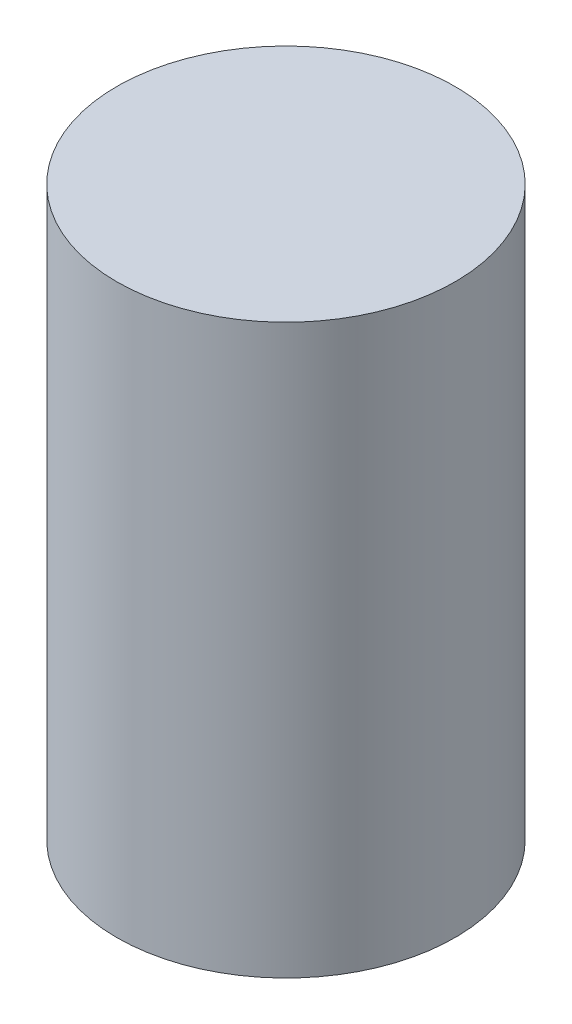
ISO-10303-21;
HEADER;
FILE_DESCRIPTION(('STEP AP214'),'2;1');
FILE_NAME('part.step','',(''),(''),'','','');
FILE_SCHEMA(('AUTOMOTIVE_DESIGN { 1 0 10303 214 1 1 1 1 }'));
ENDSEC;
DATA;
#1=APPLICATION_CONTEXT('core data for automotive mechanical design processes');
#2=APPLICATION_PROTOCOL_DEFINITION('international standard','automotive_design',2000,#1);
#3=PRODUCT_CONTEXT('',#1,'mechanical');
#4=PRODUCT('Part','Part','',(#3));
#5=PRODUCT_RELATED_PRODUCT_CATEGORY('part','',(#4));
#6=PRODUCT_DEFINITION_FORMATION('','',#4);
#7=PRODUCT_DEFINITION_CONTEXT('part definition',#1,'design');
#8=PRODUCT_DEFINITION('design','',#6,#7);
#9=PRODUCT_DEFINITION_SHAPE('','',#8);
#10=(LENGTH_UNIT() NAMED_UNIT(*) SI_UNIT(.MILLI.,.METRE.));
#11=(NAMED_UNIT(*) PLANE_ANGLE_UNIT() SI_UNIT($,.RADIAN.));
#12=(NAMED_UNIT(*) SI_UNIT($,.STERADIAN.) SOLID_ANGLE_UNIT());
#13=UNCERTAINTY_MEASURE_WITH_UNIT(LENGTH_MEASURE(1.E-05),#10,'distance_accuracy_value','');
#14=(GEOMETRIC_REPRESENTATION_CONTEXT(3) GLOBAL_UNCERTAINTY_ASSIGNED_CONTEXT((#13)) GLOBAL_UNIT_ASSIGNED_CONTEXT((#10,
#11,#12)) REPRESENTATION_CONTEXT('',''));
#15=CARTESIAN_POINT('',(0.,0.,0.));
#16=DIRECTION('',(0.,0.,1.));
#17=DIRECTION('',(1.,0.,0.));
#18=AXIS2_PLACEMENT_3D('',#15,#16,#17);
#19=CARTESIAN_POINT('',(0.,23.5,0.));
#20=DIRECTION('',(0.,-1.,0.));
#21=DIRECTION('',(0.,0.,-1.));
#22=AXIS2_PLACEMENT_3D('',#19,#20,#21);
#23=CYLINDRICAL_SURFACE('',#22,14.);
#24=CARTESIAN_POINT('',(0.,23.5,0.));
#25=DIRECTION('',(0.,1.,0.));
#26=DIRECTION('',(0.,0.,1.));
#27=AXIS2_PLACEMENT_3D('',#24,#25,#26);
#28=CIRCLE('',#27,14.);
#29=CARTESIAN_POINT('',(0.,23.5,14.));
#30=VERTEX_POINT('',#29);
#31=EDGE_CURVE('E10',#30,#30,#28,.T.);
#32=ORIENTED_EDGE('',*,*,#31,.F.);
#33=EDGE_LOOP('',(#32));
#34=FACE_BOUND('',#33,.T.);
#35=CARTESIAN_POINT('',(0.,-23.5,0.));
#36=DIRECTION('',(0.,1.,0.));
#37=DIRECTION('',(0.,0.,1.));
#38=AXIS2_PLACEMENT_3D('',#35,#36,#37);
#39=CIRCLE('',#38,14.);
#40=CARTESIAN_POINT('',(0.,-23.5,14.));
#41=VERTEX_POINT('',#40);
#42=EDGE_CURVE('E37',#41,#41,#39,.T.);
#43=ORIENTED_EDGE('',*,*,#42,.T.);
#44=EDGE_LOOP('',(#43));
#45=FACE_BOUND('',#44,.T.);
#46=ADVANCED_FACE('F34',(#34,#45),#23,.T.);
#47=CARTESIAN_POINT('',(0.,23.5,0.));
#48=DIRECTION('',(0.,1.,0.));
#49=DIRECTION('',(0.,0.,1.));
#50=AXIS2_PLACEMENT_3D('',#47,#48,#49);
#51=PLANE('',#50);
#52=ORIENTED_EDGE('',*,*,#31,.T.);
#53=EDGE_LOOP('',(#52));
#54=FACE_BOUND('',#53,.T.);
#55=ADVANCED_FACE('F49',(#54),#51,.T.);
#56=CARTESIAN_POINT('',(0.,-23.5,0.));
#57=DIRECTION('',(0.,1.,0.));
#58=DIRECTION('',(0.,0.,1.));
#59=AXIS2_PLACEMENT_3D('',#56,#57,#58);
#60=PLANE('',#59);
#61=ORIENTED_EDGE('',*,*,#42,.F.);
#62=EDGE_LOOP('',(#61));
#63=FACE_BOUND('',#62,.T.);
#64=ADVANCED_FACE('F47',(#63),#60,.F.);
#65=CLOSED_SHELL('',(#46,#55,#64));
#66=MANIFOLD_SOLID_BREP('B2',#65);
#67=ADVANCED_BREP_SHAPE_REPRESENTATION('',(#18,#66),#14);
#68=SHAPE_DEFINITION_REPRESENTATION(#9,#67);
ENDSEC;
END-ISO-10303-21;
